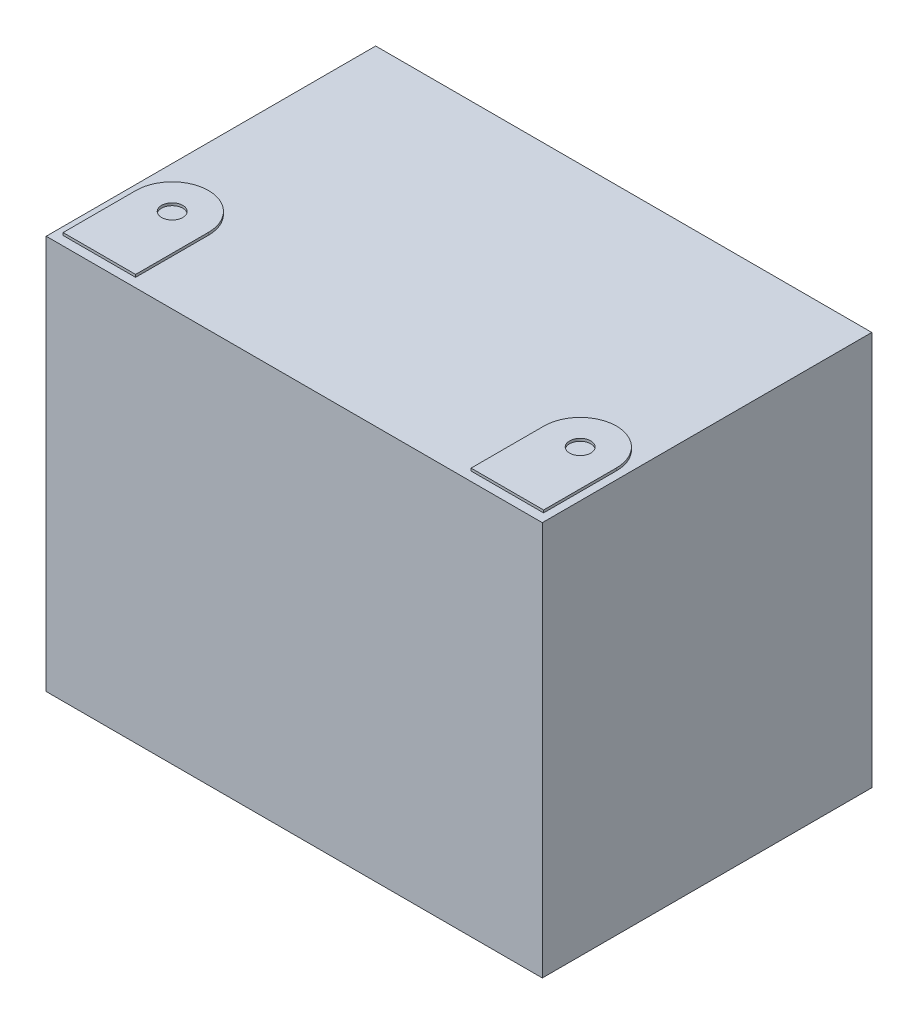
ISO-10303-21;
HEADER;
FILE_DESCRIPTION(('STEP AP214'),'2;1');
FILE_NAME('part.step','',(''),(''),'','','');
FILE_SCHEMA(('AUTOMOTIVE_DESIGN { 1 0 10303 214 1 1 1 1 }'));
ENDSEC;
DATA;
#1=APPLICATION_CONTEXT('core data for automotive mechanical design processes');
#2=APPLICATION_PROTOCOL_DEFINITION('international standard','automotive_design',2000,#1);
#3=PRODUCT_CONTEXT('',#1,'mechanical');
#4=PRODUCT('Part','Part','',(#3));
#5=PRODUCT_RELATED_PRODUCT_CATEGORY('part','',(#4));
#6=PRODUCT_DEFINITION_FORMATION('','',#4);
#7=PRODUCT_DEFINITION_CONTEXT('part definition',#1,'design');
#8=PRODUCT_DEFINITION('design','',#6,#7);
#9=PRODUCT_DEFINITION_SHAPE('','',#8);
#10=(LENGTH_UNIT() NAMED_UNIT(*) SI_UNIT(.MILLI.,.METRE.));
#11=(NAMED_UNIT(*) PLANE_ANGLE_UNIT() SI_UNIT($,.RADIAN.));
#12=(NAMED_UNIT(*) SI_UNIT($,.STERADIAN.) SOLID_ANGLE_UNIT());
#13=UNCERTAINTY_MEASURE_WITH_UNIT(LENGTH_MEASURE(1.E-05),#10,'distance_accuracy_value','');
#14=(GEOMETRIC_REPRESENTATION_CONTEXT(3) GLOBAL_UNCERTAINTY_ASSIGNED_CONTEXT((#13)) GLOBAL_UNIT_ASSIGNED_CONTEXT((#10,
#11,#12)) REPRESENTATION_CONTEXT('',''));
#15=CARTESIAN_POINT('',(0.,0.,0.));
#16=DIRECTION('',(0.,0.,1.));
#17=DIRECTION('',(1.,0.,0.));
#18=AXIS2_PLACEMENT_3D('',#15,#16,#17);
#19=CARTESIAN_POINT('',(0.,0.,0.));
#20=DIRECTION('',(0.,1.,0.));
#21=DIRECTION('',(0.,0.,1.));
#22=AXIS2_PLACEMENT_3D('',#19,#20,#21);
#23=PLANE('',#22);
#24=CARTESIAN_POINT('',(-80.1837536778612,0.,32.5466613983636));
#25=DIRECTION('',(0.,1.,0.));
#26=DIRECTION('',(0.,0.,1.));
#27=AXIS2_PLACEMENT_3D('',#24,#25,#26);
#28=CIRCLE('',#27,14.25);
#29=CARTESIAN_POINT('',(-94.4337536778612,0.,32.5466613983636));
#30=VERTEX_POINT('',#29);
#31=CARTESIAN_POINT('',(-65.9337536778612,0.,32.5466613983636));
#32=VERTEX_POINT('',#31);
#33=EDGE_CURVE('E151',#30,#32,#28,.F.);
#34=ORIENTED_EDGE('',*,*,#33,.T.);
#35=DIRECTION('',(0.,0.,-1.));
#36=VECTOR('',#35,1.);
#37=CARTESIAN_POINT('',(-65.9337536778612,0.,0.));
#38=LINE('',#37,#36);
#39=CARTESIAN_POINT('',(-65.9337536778612,0.,61.181302267226));
#40=VERTEX_POINT('',#39);
#41=EDGE_CURVE('E179',#40,#32,#38,.T.);
#42=ORIENTED_EDGE('',*,*,#41,.F.);
#43=DIRECTION('',(1.,0.,0.));
#44=VECTOR('',#43,1.);
#45=CARTESIAN_POINT('',(0.,0.,61.181302267226));
#46=LINE('',#45,#44);
#47=CARTESIAN_POINT('',(-94.4337536778612,0.,61.1813022672261));
#48=VERTEX_POINT('',#47);
#49=EDGE_CURVE('E62',#48,#40,#46,.T.);
#50=ORIENTED_EDGE('',*,*,#49,.F.);
#51=DIRECTION('',(0.,0.,-1.));
#52=VECTOR('',#51,1.);
#53=CARTESIAN_POINT('',(-94.4337536778612,0.,0.));
#54=LINE('',#53,#52);
#55=EDGE_CURVE('E193',#48,#30,#54,.T.);
#56=ORIENTED_EDGE('',*,*,#55,.T.);
#57=EDGE_LOOP('',(#34,#42,#50,#56));
#58=FACE_BOUND('',#57,.T.);
#59=DIRECTION('',(0.,0.,-1.));
#60=VECTOR('',#59,1.);
#61=CARTESIAN_POINT('',(97.5,0.,-64.75));
#62=LINE('',#61,#60);
#63=CARTESIAN_POINT('',(97.5000000000001,0.,64.75));
#64=VERTEX_POINT('',#63);
#65=CARTESIAN_POINT('',(97.5,0.,-64.75));
#66=VERTEX_POINT('',#65);
#67=EDGE_CURVE('E206',#64,#66,#62,.T.);
#68=ORIENTED_EDGE('',*,*,#67,.T.);
#69=DIRECTION('',(-1.,0.,0.));
#70=VECTOR('',#69,1.);
#71=CARTESIAN_POINT('',(-97.5,0.,-64.75));
#72=LINE('',#71,#70);
#73=CARTESIAN_POINT('',(-97.5,0.,-64.75));
#74=VERTEX_POINT('',#73);
#75=EDGE_CURVE('E223',#66,#74,#72,.T.);
#76=ORIENTED_EDGE('',*,*,#75,.T.);
#77=DIRECTION('',(0.,0.,1.));
#78=VECTOR('',#77,1.);
#79=CARTESIAN_POINT('',(-97.5,0.,-64.75));
#80=LINE('',#79,#78);
#81=CARTESIAN_POINT('',(-97.5,0.,64.75));
#82=VERTEX_POINT('',#81);
#83=EDGE_CURVE('E226',#74,#82,#80,.T.);
#84=ORIENTED_EDGE('',*,*,#83,.T.);
#85=DIRECTION('',(1.,0.,0.));
#86=VECTOR('',#85,1.);
#87=CARTESIAN_POINT('',(-97.5,0.,64.75));
#88=LINE('',#87,#86);
#89=EDGE_CURVE('E211',#82,#64,#88,.T.);
#90=ORIENTED_EDGE('',*,*,#89,.T.);
#91=EDGE_LOOP('',(#68,#76,#84,#90));
#92=FACE_BOUND('',#91,.T.);
#93=DIRECTION('',(0.,0.,-1.));
#94=VECTOR('',#93,1.);
#95=CARTESIAN_POINT('',(65.9337536778612,0.,0.));
#96=LINE('',#95,#94);
#97=CARTESIAN_POINT('',(65.9337536778612,0.,61.181302267226));
#98=VERTEX_POINT('',#97);
#99=CARTESIAN_POINT('',(65.9337536778612,0.,32.5466613983636));
#100=VERTEX_POINT('',#99);
#101=EDGE_CURVE('E166',#98,#100,#96,.T.);
#102=ORIENTED_EDGE('',*,*,#101,.T.);
#103=CARTESIAN_POINT('',(80.1837536778612,0.,32.5466613983636));
#104=DIRECTION('',(0.,-1.,0.));
#105=DIRECTION('',(0.,0.,1.));
#106=AXIS2_PLACEMENT_3D('',#103,#104,#105);
#107=CIRCLE('',#106,14.25);
#108=CARTESIAN_POINT('',(94.4337536778612,0.,32.5466613983636));
#109=VERTEX_POINT('',#108);
#110=EDGE_CURVE('E147',#109,#100,#107,.F.);
#111=ORIENTED_EDGE('',*,*,#110,.F.);
#112=DIRECTION('',(0.,0.,-1.));
#113=VECTOR('',#112,1.);
#114=CARTESIAN_POINT('',(94.4337536778612,0.,0.));
#115=LINE('',#114,#113);
#116=CARTESIAN_POINT('',(94.4337536778612,0.,61.1813022672261));
#117=VERTEX_POINT('',#116);
#118=EDGE_CURVE('E169',#117,#109,#115,.T.);
#119=ORIENTED_EDGE('',*,*,#118,.F.);
#120=DIRECTION('',(-1.,0.,0.));
#121=VECTOR('',#120,1.);
#122=CARTESIAN_POINT('',(0.,0.,61.181302267226));
#123=LINE('',#122,#121);
#124=EDGE_CURVE('E54',#117,#98,#123,.T.);
#125=ORIENTED_EDGE('',*,*,#124,.T.);
#126=EDGE_LOOP('',(#102,#111,#119,#125));
#127=FACE_BOUND('',#126,.T.);
#128=ADVANCED_FACE('F39',(#58,#92,#127),#23,.T.);
#129=CARTESIAN_POINT('',(97.5,-155.,-64.75));
#130=DIRECTION('',(1.,0.,0.));
#131=DIRECTION('',(0.,0.,-1.));
#132=AXIS2_PLACEMENT_3D('',#129,#130,#131);
#133=PLANE('',#132);
#134=ORIENTED_EDGE('',*,*,#67,.F.);
#135=DIRECTION('',(0.,1.,0.));
#136=VECTOR('',#135,1.);
#137=CARTESIAN_POINT('',(97.5000000000001,-155.,64.75));
#138=LINE('',#137,#136);
#139=CARTESIAN_POINT('',(97.5000000000001,-155.,64.75));
#140=VERTEX_POINT('',#139);
#141=EDGE_CURVE('E47',#140,#64,#138,.T.);
#142=ORIENTED_EDGE('',*,*,#141,.F.);
#143=DIRECTION('',(0.,0.,-1.));
#144=VECTOR('',#143,1.);
#145=CARTESIAN_POINT('',(97.5,-155.,-64.75));
#146=LINE('',#145,#144);
#147=CARTESIAN_POINT('',(97.5,-155.,-64.75));
#148=VERTEX_POINT('',#147);
#149=EDGE_CURVE('E207',#140,#148,#146,.T.);
#150=ORIENTED_EDGE('',*,*,#149,.T.);
#151=DIRECTION('',(0.,1.,0.));
#152=VECTOR('',#151,1.);
#153=CARTESIAN_POINT('',(97.5,-155.,-64.75));
#154=LINE('',#153,#152);
#155=EDGE_CURVE('E220',#148,#66,#154,.T.);
#156=ORIENTED_EDGE('',*,*,#155,.T.);
#157=EDGE_LOOP('',(#134,#142,#150,#156));
#158=FACE_BOUND('',#157,.T.);
#159=ADVANCED_FACE('F41',(#158),#133,.T.);
#160=CARTESIAN_POINT('',(-97.5,-155.,64.75));
#161=DIRECTION('',(0.,0.,1.));
#162=DIRECTION('',(1.,0.,0.));
#163=AXIS2_PLACEMENT_3D('',#160,#161,#162);
#164=PLANE('',#163);
#165=ORIENTED_EDGE('',*,*,#89,.F.);
#166=DIRECTION('',(0.,1.,0.));
#167=VECTOR('',#166,1.);
#168=CARTESIAN_POINT('',(-97.5,-155.,64.75));
#169=LINE('',#168,#167);
#170=CARTESIAN_POINT('',(-97.5,-155.,64.75));
#171=VERTEX_POINT('',#170);
#172=EDGE_CURVE('E232',#171,#82,#169,.T.);
#173=ORIENTED_EDGE('',*,*,#172,.F.);
#174=DIRECTION('',(1.,0.,0.));
#175=VECTOR('',#174,1.);
#176=CARTESIAN_POINT('',(-97.5,-155.,64.75));
#177=LINE('',#176,#175);
#178=EDGE_CURVE('E217',#171,#140,#177,.T.);
#179=ORIENTED_EDGE('',*,*,#178,.T.);
#180=ORIENTED_EDGE('',*,*,#141,.T.);
#181=EDGE_LOOP('',(#165,#173,#179,#180));
#182=FACE_BOUND('',#181,.T.);
#183=ADVANCED_FACE('F247',(#182),#164,.T.);
#184=CARTESIAN_POINT('',(-97.5,-155.,-64.75));
#185=DIRECTION('',(-1.,0.,0.));
#186=DIRECTION('',(0.,0.,1.));
#187=AXIS2_PLACEMENT_3D('',#184,#185,#186);
#188=PLANE('',#187);
#189=ORIENTED_EDGE('',*,*,#83,.F.);
#190=DIRECTION('',(0.,1.,0.));
#191=VECTOR('',#190,1.);
#192=CARTESIAN_POINT('',(-97.5,-155.,-64.75));
#193=LINE('',#192,#191);
#194=CARTESIAN_POINT('',(-97.5,-155.,-64.75));
#195=VERTEX_POINT('',#194);
#196=EDGE_CURVE('E234',#195,#74,#193,.T.);
#197=ORIENTED_EDGE('',*,*,#196,.F.);
#198=DIRECTION('',(0.,0.,1.));
#199=VECTOR('',#198,1.);
#200=CARTESIAN_POINT('',(-97.5,-155.,-64.75));
#201=LINE('',#200,#199);
#202=EDGE_CURVE('E214',#195,#171,#201,.T.);
#203=ORIENTED_EDGE('',*,*,#202,.T.);
#204=ORIENTED_EDGE('',*,*,#172,.T.);
#205=EDGE_LOOP('',(#189,#197,#203,#204));
#206=FACE_BOUND('',#205,.T.);
#207=ADVANCED_FACE('F253',(#206),#188,.T.);
#208=CARTESIAN_POINT('',(-97.5,-155.,-64.75));
#209=DIRECTION('',(0.,0.,-1.));
#210=DIRECTION('',(-1.,0.,0.));
#211=AXIS2_PLACEMENT_3D('',#208,#209,#210);
#212=PLANE('',#211);
#213=ORIENTED_EDGE('',*,*,#75,.F.);
#214=ORIENTED_EDGE('',*,*,#155,.F.);
#215=DIRECTION('',(-1.,0.,0.));
#216=VECTOR('',#215,1.);
#217=CARTESIAN_POINT('',(-97.5,-155.,-64.75));
#218=LINE('',#217,#216);
#219=EDGE_CURVE('E210',#148,#195,#218,.T.);
#220=ORIENTED_EDGE('',*,*,#219,.T.);
#221=ORIENTED_EDGE('',*,*,#196,.T.);
#222=EDGE_LOOP('',(#213,#214,#220,#221));
#223=FACE_BOUND('',#222,.T.);
#224=ADVANCED_FACE('F241',(#223),#212,.T.);
#225=CARTESIAN_POINT('',(0.,-155.,0.));
#226=DIRECTION('',(0.,1.,0.));
#227=DIRECTION('',(0.,0.,1.));
#228=AXIS2_PLACEMENT_3D('',#225,#226,#227);
#229=PLANE('',#228);
#230=ORIENTED_EDGE('',*,*,#149,.F.);
#231=ORIENTED_EDGE('',*,*,#178,.F.);
#232=ORIENTED_EDGE('',*,*,#202,.F.);
#233=ORIENTED_EDGE('',*,*,#219,.F.);
#234=EDGE_LOOP('',(#230,#231,#232,#233));
#235=FACE_BOUND('',#234,.T.);
#236=ADVANCED_FACE('F250',(#235),#229,.F.);
#237=CARTESIAN_POINT('',(-80.1837536778612,1.,32.5466613983636));
#238=DIRECTION('',(0.,-1.,0.));
#239=DIRECTION('',(0.,0.,-1.));
#240=AXIS2_PLACEMENT_3D('',#237,#238,#239);
#241=CYLINDRICAL_SURFACE('',#240,14.25);
#242=ORIENTED_EDGE('',*,*,#33,.F.);
#243=DIRECTION('',(0.,-1.,0.));
#244=VECTOR('',#243,1.);
#245=CARTESIAN_POINT('',(-94.4337536778612,1.,32.5466613983636));
#246=LINE('',#245,#244);
#247=CARTESIAN_POINT('',(-94.4337536778612,1.,32.5466613983636));
#248=VERTEX_POINT('',#247);
#249=EDGE_CURVE('E204',#248,#30,#246,.T.);
#250=ORIENTED_EDGE('',*,*,#249,.F.);
#251=CARTESIAN_POINT('',(-80.1837536778612,1.,32.5466613983636));
#252=DIRECTION('',(0.,1.,0.));
#253=DIRECTION('',(0.,0.,1.));
#254=AXIS2_PLACEMENT_3D('',#251,#252,#253);
#255=CIRCLE('',#254,14.25);
#256=CARTESIAN_POINT('',(-65.9337536778612,1.,32.5466613983636));
#257=VERTEX_POINT('',#256);
#258=EDGE_CURVE('E178',#248,#257,#255,.F.);
#259=ORIENTED_EDGE('',*,*,#258,.T.);
#260=DIRECTION('',(0.,-1.,0.));
#261=VECTOR('',#260,1.);
#262=CARTESIAN_POINT('',(-65.9337536778612,1.,32.5466613983636));
#263=LINE('',#262,#261);
#264=EDGE_CURVE('E190',#257,#32,#263,.T.);
#265=ORIENTED_EDGE('',*,*,#264,.T.);
#266=EDGE_LOOP('',(#242,#250,#259,#265));
#267=FACE_BOUND('',#266,.T.);
#268=ADVANCED_FACE('F313',(#267),#241,.T.);
#269=CARTESIAN_POINT('',(-94.4337536778612,1.,0.));
#270=DIRECTION('',(-1.,0.,0.));
#271=DIRECTION('',(0.,0.,1.));
#272=AXIS2_PLACEMENT_3D('',#269,#270,#271);
#273=PLANE('',#272);
#274=ORIENTED_EDGE('',*,*,#55,.F.);
#275=DIRECTION('',(0.,-1.,0.));
#276=VECTOR('',#275,1.);
#277=CARTESIAN_POINT('',(-94.4337536778612,1.,61.1813022672261));
#278=LINE('',#277,#276);
#279=CARTESIAN_POINT('',(-94.4337536778612,1.,61.1813022672261));
#280=VERTEX_POINT('',#279);
#281=EDGE_CURVE('E202',#280,#48,#278,.T.);
#282=ORIENTED_EDGE('',*,*,#281,.F.);
#283=DIRECTION('',(0.,0.,-1.));
#284=VECTOR('',#283,1.);
#285=CARTESIAN_POINT('',(-94.4337536778612,1.,0.));
#286=LINE('',#285,#284);
#287=EDGE_CURVE('E182',#280,#248,#286,.T.);
#288=ORIENTED_EDGE('',*,*,#287,.T.);
#289=ORIENTED_EDGE('',*,*,#249,.T.);
#290=EDGE_LOOP('',(#274,#282,#288,#289));
#291=FACE_BOUND('',#290,.T.);
#292=ADVANCED_FACE('F310',(#291),#273,.T.);
#293=CARTESIAN_POINT('',(0.,1.,61.181302267226));
#294=DIRECTION('',(0.,0.,-1.));
#295=DIRECTION('',(-1.,0.,0.));
#296=AXIS2_PLACEMENT_3D('',#293,#294,#295);
#297=PLANE('',#296);
#298=ORIENTED_EDGE('',*,*,#49,.T.);
#299=DIRECTION('',(0.,-1.,0.));
#300=VECTOR('',#299,1.);
#301=CARTESIAN_POINT('',(-65.9337536778612,1.,61.181302267226));
#302=LINE('',#301,#300);
#303=CARTESIAN_POINT('',(-65.9337536778612,1.,61.181302267226));
#304=VERTEX_POINT('',#303);
#305=EDGE_CURVE('E200',#304,#40,#302,.T.);
#306=ORIENTED_EDGE('',*,*,#305,.F.);
#307=DIRECTION('',(1.,0.,0.));
#308=VECTOR('',#307,1.);
#309=CARTESIAN_POINT('',(0.,1.,61.181302267226));
#310=LINE('',#309,#308);
#311=EDGE_CURVE('E185',#280,#304,#310,.T.);
#312=ORIENTED_EDGE('',*,*,#311,.F.);
#313=ORIENTED_EDGE('',*,*,#281,.T.);
#314=EDGE_LOOP('',(#298,#306,#312,#313));
#315=FACE_BOUND('',#314,.T.);
#316=ADVANCED_FACE('F307',(#315),#297,.F.);
#317=CARTESIAN_POINT('',(-80.1837536778612,1.,32.5466613983636));
#318=DIRECTION('',(0.,-1.,0.));
#319=DIRECTION('',(0.,0.,-1.));
#320=AXIS2_PLACEMENT_3D('',#317,#318,#319);
#321=CYLINDRICAL_SURFACE('',#320,4.1640526375061);
#322=CARTESIAN_POINT('',(-80.1837536778612,1.,32.5466613983636));
#323=DIRECTION('',(0.,1.,0.));
#324=DIRECTION('',(0.,0.,1.));
#325=AXIS2_PLACEMENT_3D('',#322,#323,#324);
#326=CIRCLE('',#325,4.1640526375061);
#327=CARTESIAN_POINT('',(-80.1837536778612,1.,36.7107140358697));
#328=VERTEX_POINT('',#327);
#329=EDGE_CURVE('E175',#328,#328,#326,.T.);
#330=ORIENTED_EDGE('',*,*,#329,.T.);
#331=EDGE_LOOP('',(#330));
#332=FACE_BOUND('',#331,.T.);
#333=CARTESIAN_POINT('',(-80.1837536778612,0.,32.5466613983636));
#334=DIRECTION('',(0.,1.,0.));
#335=DIRECTION('',(0.,0.,1.));
#336=AXIS2_PLACEMENT_3D('',#333,#334,#335);
#337=CIRCLE('',#336,4.1640526375061);
#338=CARTESIAN_POINT('',(-80.1837536778612,0.,36.7107140358697));
#339=VERTEX_POINT('',#338);
#340=EDGE_CURVE('E11',#339,#339,#337,.F.);
#341=ORIENTED_EDGE('',*,*,#340,.T.);
#342=EDGE_LOOP('',(#341));
#343=FACE_BOUND('',#342,.T.);
#344=ADVANCED_FACE('F305',(#332,#343),#321,.F.);
#345=CARTESIAN_POINT('',(-65.9337536778612,1.,0.));
#346=DIRECTION('',(-1.,0.,0.));
#347=DIRECTION('',(0.,0.,1.));
#348=AXIS2_PLACEMENT_3D('',#345,#346,#347);
#349=PLANE('',#348);
#350=ORIENTED_EDGE('',*,*,#41,.T.);
#351=ORIENTED_EDGE('',*,*,#264,.F.);
#352=DIRECTION('',(0.,0.,-1.));
#353=VECTOR('',#352,1.);
#354=CARTESIAN_POINT('',(-65.9337536778612,1.,0.));
#355=LINE('',#354,#353);
#356=EDGE_CURVE('E188',#304,#257,#355,.T.);
#357=ORIENTED_EDGE('',*,*,#356,.F.);
#358=ORIENTED_EDGE('',*,*,#305,.T.);
#359=EDGE_LOOP('',(#350,#351,#357,#358));
#360=FACE_BOUND('',#359,.T.);
#361=ADVANCED_FACE('F301',(#360),#349,.F.);
#362=CARTESIAN_POINT('',(0.,1.,0.));
#363=DIRECTION('',(0.,1.,0.));
#364=DIRECTION('',(0.,0.,1.));
#365=AXIS2_PLACEMENT_3D('',#362,#363,#364);
#366=PLANE('',#365);
#367=ORIENTED_EDGE('',*,*,#329,.F.);
#368=EDGE_LOOP('',(#367));
#369=FACE_BOUND('',#368,.T.);
#370=ORIENTED_EDGE('',*,*,#258,.F.);
#371=ORIENTED_EDGE('',*,*,#287,.F.);
#372=ORIENTED_EDGE('',*,*,#311,.T.);
#373=ORIENTED_EDGE('',*,*,#356,.T.);
#374=EDGE_LOOP('',(#370,#371,#372,#373));
#375=FACE_BOUND('',#374,.T.);
#376=ADVANCED_FACE('F271',(#369,#375),#366,.T.);
#377=ORIENTED_EDGE('',*,*,#340,.F.);
#378=EDGE_LOOP('',(#377));
#379=FACE_BOUND('',#378,.T.);
#380=ADVANCED_FACE('F264',(#379),#23,.T.);
#381=CARTESIAN_POINT('',(80.1837536778612,1.,32.5466613983636));
#382=DIRECTION('',(0.,-1.,0.));
#383=DIRECTION('',(0.,0.,-1.));
#384=AXIS2_PLACEMENT_3D('',#381,#382,#383);
#385=CYLINDRICAL_SURFACE('',#384,14.25);
#386=ORIENTED_EDGE('',*,*,#110,.T.);
#387=DIRECTION('',(0.,-1.,0.));
#388=VECTOR('',#387,1.);
#389=CARTESIAN_POINT('',(65.9337536778612,1.,32.5466613983636));
#390=LINE('',#389,#388);
#391=CARTESIAN_POINT('',(65.9337536778612,1.,32.5466613983636));
#392=VERTEX_POINT('',#391);
#393=EDGE_CURVE('E144',#392,#100,#390,.T.);
#394=ORIENTED_EDGE('',*,*,#393,.F.);
#395=CARTESIAN_POINT('',(80.1837536778612,1.,32.5466613983636));
#396=DIRECTION('',(0.,-1.,0.));
#397=DIRECTION('',(0.,0.,1.));
#398=AXIS2_PLACEMENT_3D('',#395,#396,#397);
#399=CIRCLE('',#398,14.25);
#400=CARTESIAN_POINT('',(94.4337536778612,1.,32.5466613983636));
#401=VERTEX_POINT('',#400);
#402=EDGE_CURVE('E129',#401,#392,#399,.F.);
#403=ORIENTED_EDGE('',*,*,#402,.F.);
#404=DIRECTION('',(0.,-1.,0.));
#405=VECTOR('',#404,1.);
#406=CARTESIAN_POINT('',(94.4337536778612,1.,32.5466613983636));
#407=LINE('',#406,#405);
#408=EDGE_CURVE('E161',#401,#109,#407,.T.);
#409=ORIENTED_EDGE('',*,*,#408,.T.);
#410=EDGE_LOOP('',(#386,#394,#403,#409));
#411=FACE_BOUND('',#410,.T.);
#412=ADVANCED_FACE('F145',(#411),#385,.T.);
#413=CARTESIAN_POINT('',(65.9337536778612,1.,0.));
#414=DIRECTION('',(-1.,0.,0.));
#415=DIRECTION('',(0.,0.,1.));
#416=AXIS2_PLACEMENT_3D('',#413,#414,#415);
#417=PLANE('',#416);
#418=ORIENTED_EDGE('',*,*,#101,.F.);
#419=DIRECTION('',(0.,-1.,0.));
#420=VECTOR('',#419,1.);
#421=CARTESIAN_POINT('',(65.9337536778612,1.,61.181302267226));
#422=LINE('',#421,#420);
#423=CARTESIAN_POINT('',(65.9337536778612,1.,61.181302267226));
#424=VERTEX_POINT('',#423);
#425=EDGE_CURVE('E152',#424,#98,#422,.T.);
#426=ORIENTED_EDGE('',*,*,#425,.F.);
#427=DIRECTION('',(0.,0.,-1.));
#428=VECTOR('',#427,1.);
#429=CARTESIAN_POINT('',(65.9337536778612,1.,0.));
#430=LINE('',#429,#428);
#431=EDGE_CURVE('E134',#424,#392,#430,.T.);
#432=ORIENTED_EDGE('',*,*,#431,.T.);
#433=ORIENTED_EDGE('',*,*,#393,.T.);
#434=EDGE_LOOP('',(#418,#426,#432,#433));
#435=FACE_BOUND('',#434,.T.);
#436=ADVANCED_FACE('F154',(#435),#417,.T.);
#437=CARTESIAN_POINT('',(0.,1.,61.181302267226));
#438=DIRECTION('',(0.,0.,1.));
#439=DIRECTION('',(1.,0.,0.));
#440=AXIS2_PLACEMENT_3D('',#437,#438,#439);
#441=PLANE('',#440);
#442=ORIENTED_EDGE('',*,*,#124,.F.);
#443=DIRECTION('',(0.,-1.,0.));
#444=VECTOR('',#443,1.);
#445=CARTESIAN_POINT('',(94.4337536778612,1.,61.1813022672261));
#446=LINE('',#445,#444);
#447=CARTESIAN_POINT('',(94.4337536778612,1.,61.1813022672261));
#448=VERTEX_POINT('',#447);
#449=EDGE_CURVE('E172',#448,#117,#446,.T.);
#450=ORIENTED_EDGE('',*,*,#449,.F.);
#451=DIRECTION('',(-1.,0.,0.));
#452=VECTOR('',#451,1.);
#453=CARTESIAN_POINT('',(0.,1.,61.181302267226));
#454=LINE('',#453,#452);
#455=EDGE_CURVE('E155',#448,#424,#454,.T.);
#456=ORIENTED_EDGE('',*,*,#455,.T.);
#457=ORIENTED_EDGE('',*,*,#425,.T.);
#458=EDGE_LOOP('',(#442,#450,#456,#457));
#459=FACE_BOUND('',#458,.T.);
#460=ADVANCED_FACE('F285',(#459),#441,.T.);
#461=CARTESIAN_POINT('',(80.1837536778612,1.,32.5466613983636));
#462=DIRECTION('',(0.,-1.,0.));
#463=DIRECTION('',(0.,0.,-1.));
#464=AXIS2_PLACEMENT_3D('',#461,#462,#463);
#465=CYLINDRICAL_SURFACE('',#464,4.1640526375061);
#466=CARTESIAN_POINT('',(80.1837536778612,1.,32.5466613983636));
#467=DIRECTION('',(0.,-1.,0.));
#468=DIRECTION('',(0.,0.,1.));
#469=AXIS2_PLACEMENT_3D('',#466,#467,#468);
#470=CIRCLE('',#469,4.1640526375061);
#471=CARTESIAN_POINT('',(80.1837536778612,1.,36.7107140358697));
#472=VERTEX_POINT('',#471);
#473=EDGE_CURVE('E141',#472,#472,#470,.T.);
#474=ORIENTED_EDGE('',*,*,#473,.F.);
#475=EDGE_LOOP('',(#474));
#476=FACE_BOUND('',#475,.T.);
#477=CARTESIAN_POINT('',(80.1837536778612,0.,32.5466613983636));
#478=DIRECTION('',(0.,-1.,0.));
#479=DIRECTION('',(0.,0.,1.));
#480=AXIS2_PLACEMENT_3D('',#477,#478,#479);
#481=CIRCLE('',#480,4.1640526375061);
#482=CARTESIAN_POINT('',(80.1837536778612,0.,36.7107140358697));
#483=VERTEX_POINT('',#482);
#484=EDGE_CURVE('E162',#483,#483,#481,.T.);
#485=ORIENTED_EDGE('',*,*,#484,.T.);
#486=EDGE_LOOP('',(#485));
#487=FACE_BOUND('',#486,.T.);
#488=ADVANCED_FACE('F283',(#476,#487),#465,.F.);
#489=CARTESIAN_POINT('',(94.4337536778612,1.,0.));
#490=DIRECTION('',(-1.,0.,0.));
#491=DIRECTION('',(0.,0.,1.));
#492=AXIS2_PLACEMENT_3D('',#489,#490,#491);
#493=PLANE('',#492);
#494=ORIENTED_EDGE('',*,*,#118,.T.);
#495=ORIENTED_EDGE('',*,*,#408,.F.);
#496=DIRECTION('',(0.,0.,-1.));
#497=VECTOR('',#496,1.);
#498=CARTESIAN_POINT('',(94.4337536778612,1.,0.));
#499=LINE('',#498,#497);
#500=EDGE_CURVE('E137',#448,#401,#499,.T.);
#501=ORIENTED_EDGE('',*,*,#500,.F.);
#502=ORIENTED_EDGE('',*,*,#449,.T.);
#503=EDGE_LOOP('',(#494,#495,#501,#502));
#504=FACE_BOUND('',#503,.T.);
#505=ADVANCED_FACE('F278',(#504),#493,.F.);
#506=CARTESIAN_POINT('',(0.,1.,0.));
#507=DIRECTION('',(0.,1.,0.));
#508=DIRECTION('',(0.,0.,1.));
#509=AXIS2_PLACEMENT_3D('',#506,#507,#508);
#510=PLANE('',#509);
#511=ORIENTED_EDGE('',*,*,#473,.T.);
#512=EDGE_LOOP('',(#511));
#513=FACE_BOUND('',#512,.T.);
#514=ORIENTED_EDGE('',*,*,#402,.T.);
#515=ORIENTED_EDGE('',*,*,#431,.F.);
#516=ORIENTED_EDGE('',*,*,#455,.F.);
#517=ORIENTED_EDGE('',*,*,#500,.T.);
#518=EDGE_LOOP('',(#514,#515,#516,#517));
#519=FACE_BOUND('',#518,.T.);
#520=ADVANCED_FACE('F131',(#513,#519),#510,.T.);
#521=ORIENTED_EDGE('',*,*,#484,.F.);
#522=EDGE_LOOP('',(#521));
#523=FACE_BOUND('',#522,.T.);
#524=ADVANCED_FACE('F265',(#523),#23,.T.);
#525=CLOSED_SHELL('',(#128,#159,#183,#207,#224,#236,#268,#292,#316,#344,#361,#376,#380,#412,
#436,#460,#488,#505,#520,#524));
#526=MANIFOLD_SOLID_BREP('B2',#525);
#527=ADVANCED_BREP_SHAPE_REPRESENTATION('',(#18,#526),#14);
#528=SHAPE_DEFINITION_REPRESENTATION(#9,#527);
ENDSEC;
END-ISO-10303-21;
